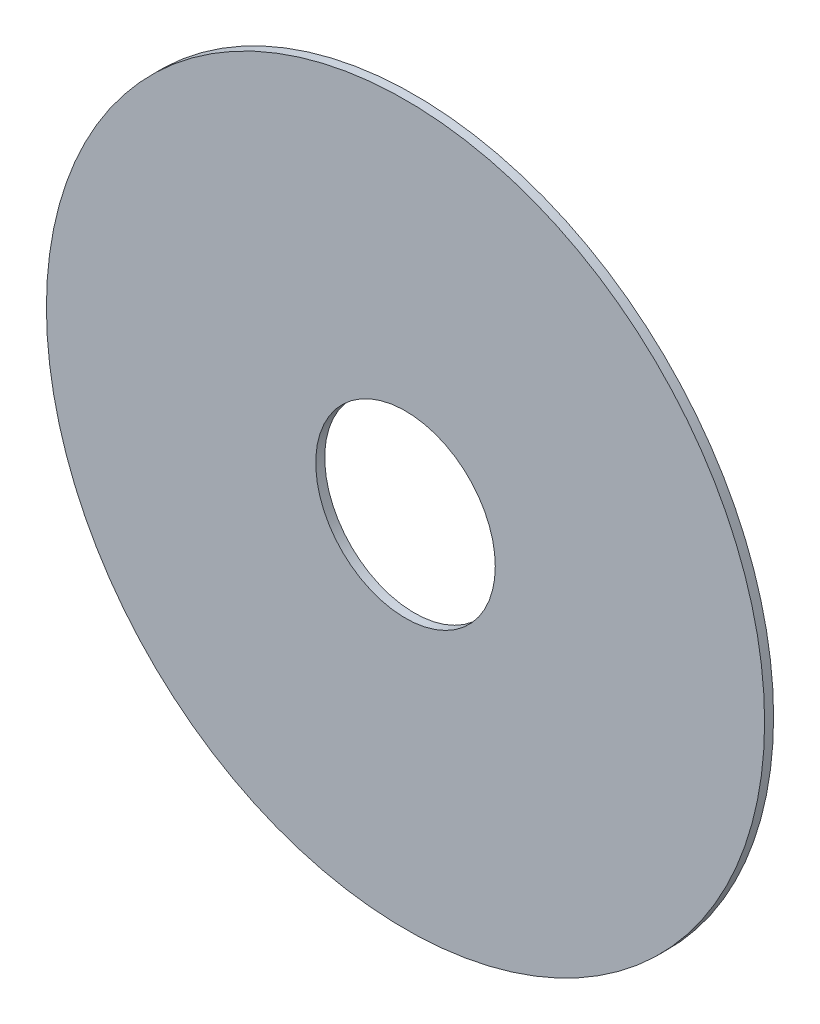
ISO-10303-21;
HEADER;
FILE_DESCRIPTION(('STEP AP214'),'2;1');
FILE_NAME('part.step','',(''),(''),'','','');
FILE_SCHEMA(('AUTOMOTIVE_DESIGN { 1 0 10303 214 1 1 1 1 }'));
ENDSEC;
DATA;
#1=APPLICATION_CONTEXT('core data for automotive mechanical design processes');
#2=APPLICATION_PROTOCOL_DEFINITION('international standard','automotive_design',2000,#1);
#3=PRODUCT_CONTEXT('',#1,'mechanical');
#4=PRODUCT('Part','Part','',(#3));
#5=PRODUCT_RELATED_PRODUCT_CATEGORY('part','',(#4));
#6=PRODUCT_DEFINITION_FORMATION('','',#4);
#7=PRODUCT_DEFINITION_CONTEXT('part definition',#1,'design');
#8=PRODUCT_DEFINITION('design','',#6,#7);
#9=PRODUCT_DEFINITION_SHAPE('','',#8);
#10=(LENGTH_UNIT() NAMED_UNIT(*) SI_UNIT(.MILLI.,.METRE.));
#11=(NAMED_UNIT(*) PLANE_ANGLE_UNIT() SI_UNIT($,.RADIAN.));
#12=(NAMED_UNIT(*) SI_UNIT($,.STERADIAN.) SOLID_ANGLE_UNIT());
#13=UNCERTAINTY_MEASURE_WITH_UNIT(LENGTH_MEASURE(1.E-05),#10,'distance_accuracy_value','');
#14=(GEOMETRIC_REPRESENTATION_CONTEXT(3) GLOBAL_UNCERTAINTY_ASSIGNED_CONTEXT((#13)) GLOBAL_UNIT_ASSIGNED_CONTEXT((#10,
#11,#12)) REPRESENTATION_CONTEXT('',''));
#15=CARTESIAN_POINT('',(0.,0.,0.));
#16=DIRECTION('',(0.,0.,1.));
#17=DIRECTION('',(1.,0.,0.));
#18=AXIS2_PLACEMENT_3D('',#15,#16,#17);
#19=CARTESIAN_POINT('',(0.,0.,0.));
#20=DIRECTION('',(0.,0.,1.));
#21=DIRECTION('',(1.,0.,0.));
#22=AXIS2_PLACEMENT_3D('',#19,#20,#21);
#23=PLANE('',#22);
#24=CARTESIAN_POINT('',(0.,0.,0.));
#25=DIRECTION('',(0.,0.,1.));
#26=DIRECTION('',(1.,0.,0.));
#27=AXIS2_PLACEMENT_3D('',#24,#25,#26);
#28=CIRCLE('',#27,5.);
#29=CARTESIAN_POINT('',(5.,0.,0.));
#30=VERTEX_POINT('',#29);
#31=EDGE_CURVE('E27',#30,#30,#28,.T.);
#32=ORIENTED_EDGE('',*,*,#31,.T.);
#33=EDGE_LOOP('',(#32));
#34=FACE_BOUND('',#33,.T.);
#35=CARTESIAN_POINT('',(0.,0.,0.));
#36=DIRECTION('',(0.,0.,1.));
#37=DIRECTION('',(1.,0.,0.));
#38=AXIS2_PLACEMENT_3D('',#35,#36,#37);
#39=CIRCLE('',#38,20.);
#40=CARTESIAN_POINT('',(20.,0.,0.));
#41=VERTEX_POINT('',#40);
#42=EDGE_CURVE('E18',#41,#41,#39,.T.);
#43=ORIENTED_EDGE('',*,*,#42,.F.);
#44=EDGE_LOOP('',(#43));
#45=FACE_BOUND('',#44,.T.);
#46=ADVANCED_FACE('F15',(#34,#45),#23,.F.);
#47=CARTESIAN_POINT('',(0.,0.,0.));
#48=DIRECTION('',(0.,0.,1.));
#49=DIRECTION('',(1.,0.,0.));
#50=AXIS2_PLACEMENT_3D('',#47,#48,#49);
#51=CYLINDRICAL_SURFACE('',#50,20.);
#52=CARTESIAN_POINT('',(0.,0.,0.5));
#53=DIRECTION('',(0.,0.,1.));
#54=DIRECTION('',(1.,0.,0.));
#55=AXIS2_PLACEMENT_3D('',#52,#53,#54);
#56=CIRCLE('',#55,20.);
#57=CARTESIAN_POINT('',(20.,0.,0.5));
#58=VERTEX_POINT('',#57);
#59=EDGE_CURVE('E22',#58,#58,#56,.T.);
#60=ORIENTED_EDGE('',*,*,#59,.F.);
#61=EDGE_LOOP('',(#60));
#62=FACE_BOUND('',#61,.T.);
#63=ORIENTED_EDGE('',*,*,#42,.T.);
#64=EDGE_LOOP('',(#63));
#65=FACE_BOUND('',#64,.T.);
#66=ADVANCED_FACE('F35',(#62,#65),#51,.T.);
#67=CARTESIAN_POINT('',(0.,0.,0.));
#68=DIRECTION('',(0.,0.,1.));
#69=DIRECTION('',(1.,0.,0.));
#70=AXIS2_PLACEMENT_3D('',#67,#68,#69);
#71=CYLINDRICAL_SURFACE('',#70,5.);
#72=CARTESIAN_POINT('',(0.,0.,0.5));
#73=DIRECTION('',(0.,0.,1.));
#74=DIRECTION('',(1.,0.,0.));
#75=AXIS2_PLACEMENT_3D('',#72,#73,#74);
#76=CIRCLE('',#75,5.);
#77=CARTESIAN_POINT('',(5.,0.,0.5));
#78=VERTEX_POINT('',#77);
#79=EDGE_CURVE('E10',#78,#78,#76,.F.);
#80=ORIENTED_EDGE('',*,*,#79,.F.);
#81=EDGE_LOOP('',(#80));
#82=FACE_BOUND('',#81,.T.);
#83=ORIENTED_EDGE('',*,*,#31,.F.);
#84=EDGE_LOOP('',(#83));
#85=FACE_BOUND('',#84,.T.);
#86=ADVANCED_FACE('F42',(#82,#85),#71,.F.);
#87=CARTESIAN_POINT('',(0.,0.,0.5));
#88=DIRECTION('',(0.,0.,1.));
#89=DIRECTION('',(1.,0.,0.));
#90=AXIS2_PLACEMENT_3D('',#87,#88,#89);
#91=PLANE('',#90);
#92=ORIENTED_EDGE('',*,*,#79,.T.);
#93=EDGE_LOOP('',(#92));
#94=FACE_BOUND('',#93,.T.);
#95=ORIENTED_EDGE('',*,*,#59,.T.);
#96=EDGE_LOOP('',(#95));
#97=FACE_BOUND('',#96,.T.);
#98=ADVANCED_FACE('F44',(#94,#97),#91,.T.);
#99=CLOSED_SHELL('',(#46,#66,#86,#98));
#100=MANIFOLD_SOLID_BREP('B1',#99);
#101=ADVANCED_BREP_SHAPE_REPRESENTATION('',(#18,#100),#14);
#102=SHAPE_DEFINITION_REPRESENTATION(#9,#101);
ENDSEC;
END-ISO-10303-21;
